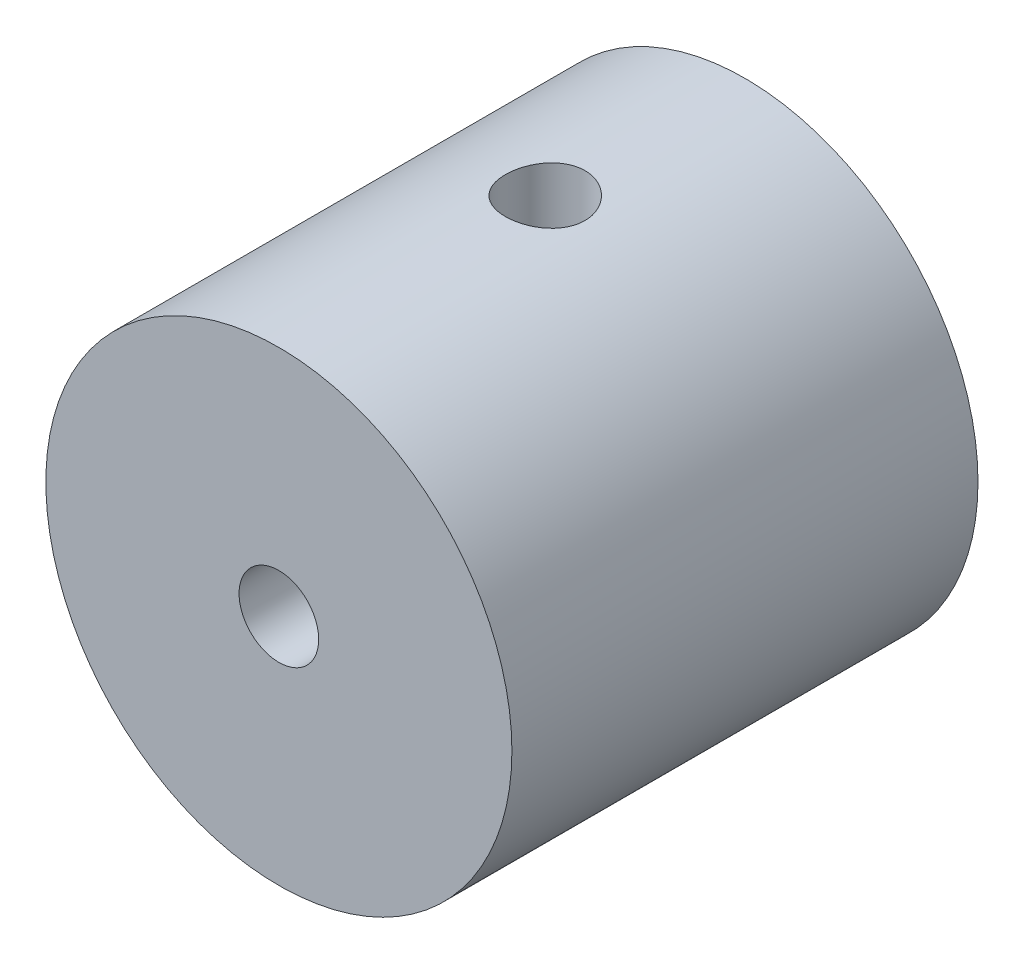
ISO-10303-21;
HEADER;
FILE_DESCRIPTION(('STEP AP214'),'2;1');
FILE_NAME('part.step','',(''),(''),'','','');
FILE_SCHEMA(('AUTOMOTIVE_DESIGN { 1 0 10303 214 1 1 1 1 }'));
ENDSEC;
DATA;
#1=APPLICATION_CONTEXT('core data for automotive mechanical design processes');
#2=APPLICATION_PROTOCOL_DEFINITION('international standard','automotive_design',2000,#1);
#3=PRODUCT_CONTEXT('',#1,'mechanical');
#4=PRODUCT('Part','Part','',(#3));
#5=PRODUCT_RELATED_PRODUCT_CATEGORY('part','',(#4));
#6=PRODUCT_DEFINITION_FORMATION('','',#4);
#7=PRODUCT_DEFINITION_CONTEXT('part definition',#1,'design');
#8=PRODUCT_DEFINITION('design','',#6,#7);
#9=PRODUCT_DEFINITION_SHAPE('','',#8);
#10=(LENGTH_UNIT() NAMED_UNIT(*) SI_UNIT(.MILLI.,.METRE.));
#11=(NAMED_UNIT(*) PLANE_ANGLE_UNIT() SI_UNIT($,.RADIAN.));
#12=(NAMED_UNIT(*) SI_UNIT($,.STERADIAN.) SOLID_ANGLE_UNIT());
#13=UNCERTAINTY_MEASURE_WITH_UNIT(LENGTH_MEASURE(1.E-05),#10,'distance_accuracy_value','');
#14=(GEOMETRIC_REPRESENTATION_CONTEXT(3) GLOBAL_UNCERTAINTY_ASSIGNED_CONTEXT((#13)) GLOBAL_UNIT_ASSIGNED_CONTEXT((#10,
#11,#12)) REPRESENTATION_CONTEXT('',''));
#15=CARTESIAN_POINT('',(0.,0.,0.));
#16=DIRECTION('',(0.,0.,1.));
#17=DIRECTION('',(1.,0.,0.));
#18=AXIS2_PLACEMENT_3D('',#15,#16,#17);
#19=CARTESIAN_POINT('',(0.,0.,0.));
#20=DIRECTION('',(0.,0.,1.));
#21=DIRECTION('',(1.,0.,0.));
#22=AXIS2_PLACEMENT_3D('',#19,#20,#21);
#23=CYLINDRICAL_SURFACE('',#22,1.89865);
#24=CARTESIAN_POINT('',(0.,0.,0.));
#25=DIRECTION('',(0.,0.,1.));
#26=DIRECTION('',(1.,0.,0.));
#27=AXIS2_PLACEMENT_3D('',#24,#25,#26);
#28=CIRCLE('',#27,1.89865);
#29=CARTESIAN_POINT('',(1.89865,0.,0.));
#30=VERTEX_POINT('',#29);
#31=EDGE_CURVE('E73',#30,#30,#28,.T.);
#32=ORIENTED_EDGE('',*,*,#31,.T.);
#33=EDGE_LOOP('',(#32));
#34=FACE_BOUND('',#33,.T.);
#35=CARTESIAN_POINT('',(0.,0.,-12.7));
#36=DIRECTION('',(0.,-0.707106781186547,0.707106781186548));
#37=DIRECTION('',(0.,0.707106781186547,0.707106781186549));
#38=AXIS2_PLACEMENT_3D('',#35,#36,#37);
#39=ELLIPSE('',#38,2.68509658019967,1.89864999999999);
#40=CARTESIAN_POINT('',(-1.89864999999997,0.,-12.7));
#41=VERTEX_POINT('',#40);
#42=CARTESIAN_POINT('',(1.89864999999999,0.,-12.7));
#43=VERTEX_POINT('',#42);
#44=EDGE_CURVE('E69',#41,#43,#39,.F.);
#45=ORIENTED_EDGE('',*,*,#44,.T.);
#46=CARTESIAN_POINT('',(0.,0.,-12.7));
#47=DIRECTION('',(0.,0.707106781186547,0.707106781186549));
#48=DIRECTION('',(0.,-0.707106781186547,0.707106781186548));
#49=AXIS2_PLACEMENT_3D('',#46,#47,#48);
#50=ELLIPSE('',#49,2.68509658019967,1.89864999999999);
#51=EDGE_CURVE('E13',#43,#41,#50,.F.);
#52=ORIENTED_EDGE('',*,*,#51,.T.);
#53=EDGE_LOOP('',(#45,#52));
#54=FACE_BOUND('',#53,.T.);
#55=ADVANCED_FACE('F46',(#34,#54),#23,.F.);
#56=CARTESIAN_POINT('',(0.,0.,-22.2250000000001));
#57=DIRECTION('',(0.,0.,1.));
#58=DIRECTION('',(1.,0.,0.));
#59=AXIS2_PLACEMENT_3D('',#56,#57,#58);
#60=CYLINDRICAL_SURFACE('',#59,11.1125);
#61=CARTESIAN_POINT('',(0.,-11.1124999999999,-10.8013499999999));
#62=CARTESIAN_POINT('',(-0.105822228264487,-11.1124981618856,-10.8013542075488));
#63=CARTESIAN_POINT('',(-0.211701226529086,-11.1109726937301,-10.8102269727728));
#64=CARTESIAN_POINT('',(-0.420486948857573,-11.1050342193384,-10.8454672932971));
#65=CARTESIAN_POINT('',(-0.523390894802783,-11.1006185997683,-10.8718506823632));
#66=CARTESIAN_POINT('',(-0.723175835773558,-11.089394838437,-10.941290149962));
#67=CARTESIAN_POINT('',(-0.820061778739054,-11.0825886936235,-10.9843323154787));
#68=CARTESIAN_POINT('',(-1.00522492539353,-11.0673312485652,-11.0858304907201));
#69=CARTESIAN_POINT('',(-1.09350305646538,-11.0588801258407,-11.1442848374582));
#70=CARTESIAN_POINT('',(-1.25984142987007,-11.0411740704959,-11.2755712227339));
#71=CARTESIAN_POINT('',(-1.33780285699396,-11.0319126044915,-11.3485275911649));
#72=CARTESIAN_POINT('',(-1.48044096143625,-11.0136793991156,-11.5064794677847));
#73=CARTESIAN_POINT('',(-1.5451167789052,-11.0047076785283,-11.5914757546001));
#74=CARTESIAN_POINT('',(-1.65974666930267,-10.9880064690993,-11.7717773231204));
#75=CARTESIAN_POINT('',(-1.70960248485878,-10.9802854192796,-11.8671459237006));
#76=CARTESIAN_POINT('',(-1.7925486823826,-10.9670506882431,-12.0650582825695));
#77=CARTESIAN_POINT('',(-1.8256402562131,-10.9615368501093,-12.1676015301826));
#78=CARTESIAN_POINT('',(-1.87380615556147,-10.9534060242082,-12.3759029268414));
#79=CARTESIAN_POINT('',(-1.88905142217093,-10.9507615702141,-12.4816204563071));
#80=CARTESIAN_POINT('',(-1.90162206802554,-10.9485858977546,-12.6941435497802));
#81=CARTESIAN_POINT('',(-1.89894878001368,-10.9490544477505,-12.8009490322782));
#82=CARTESIAN_POINT('',(-1.87589731758093,-10.9530267791418,-13.011392484879));
#83=CARTESIAN_POINT('',(-1.85571161890162,-10.9564975623133,-13.1150522520966));
#84=CARTESIAN_POINT('',(-1.79851059707276,-10.9660316032462,-13.3174918323712));
#85=CARTESIAN_POINT('',(-1.76149466997125,-10.9720949540414,-13.416271470164));
#86=CARTESIAN_POINT('',(-1.67149012961437,-10.9861663685527,-13.6067205026115));
#87=CARTESIAN_POINT('',(-1.61842201589715,-10.9941840721636,-13.6983515844937));
#88=CARTESIAN_POINT('',(-1.49787591256142,-11.0112541699214,-13.8714812458001));
#89=CARTESIAN_POINT('',(-1.43039670211536,-11.0203066516988,-13.9529789658566));
#90=CARTESIAN_POINT('',(-1.28189729162385,-11.0385710824753,-14.1046422338407));
#91=CARTESIAN_POINT('',(-1.20071204608565,-11.0477835719844,-14.174646214766));
#92=CARTESIAN_POINT('',(-1.0276621666073,-11.0652210490962,-14.3000628215833));
#93=CARTESIAN_POINT('',(-0.93579745720474,-11.0734460297202,-14.3554753443612));
#94=CARTESIAN_POINT('',(-0.743841251431178,-11.0879943295047,-14.4501525133858));
#95=CARTESIAN_POINT('',(-0.643742336048002,-11.094315909271,-14.4894024016191));
#96=CARTESIAN_POINT('',(-0.438240926826494,-11.104331284251,-14.5504876392027));
#97=CARTESIAN_POINT('',(-0.332838900411787,-11.1080253106279,-14.572324520511));
#98=CARTESIAN_POINT('',(-0.121115310579233,-11.1123381499893,-14.5977437277611));
#99=CARTESIAN_POINT('',(-0.014821100492509,-11.1129943113654,-14.6015477686558));
#100=CARTESIAN_POINT('',(0.196885576212192,-11.1112599511906,-14.5913851093089));
#101=CARTESIAN_POINT('',(0.30229807837252,-11.1088695530505,-14.5774191288999));
#102=CARTESIAN_POINT('',(0.508560690735103,-11.1013338091856,-14.532297272994));
#103=CARTESIAN_POINT('',(0.609435616897997,-11.0962061361596,-14.5012516302309));
#104=CARTESIAN_POINT('',(0.804548893095107,-11.0837684537404,-14.422969573908));
#105=CARTESIAN_POINT('',(0.898786854463265,-11.0764583166715,-14.3757322130967));
#106=CARTESIAN_POINT('',(1.07891096661853,-11.0603738237433,-14.2659031094232));
#107=CARTESIAN_POINT('',(1.16471184815793,-11.0515865556843,-14.2031734494668));
#108=CARTESIAN_POINT('',(1.32464830004621,-11.0335602869003,-14.0643295309645));
#109=CARTESIAN_POINT('',(1.39878297630114,-11.0243212516232,-13.9882142474947));
#110=CARTESIAN_POINT('',(1.53410844710197,-11.0063113701468,-13.8237634666165));
#111=CARTESIAN_POINT('',(1.59514914136415,-10.9975467342826,-13.7353036641667));
#112=CARTESIAN_POINT('',(1.70150428644863,-10.9815956781835,-13.5492555593587));
#113=CARTESIAN_POINT('',(1.7468192538292,-10.9744092061119,-13.4516675569772));
#114=CARTESIAN_POINT('',(1.82021435124198,-10.9624751716446,-13.2505454720078));
#115=CARTESIAN_POINT('',(1.84836805382854,-10.9577172123923,-13.1470388830988));
#116=CARTESIAN_POINT('',(1.88687214844282,-10.9511532664869,-12.9366773751239));
#117=CARTESIAN_POINT('',(1.89722417513577,-10.9493470087903,-12.8298227644127));
#118=CARTESIAN_POINT('',(1.89978370592229,-10.9489030626569,-12.6172981210472));
#119=CARTESIAN_POINT('',(1.89222756178648,-10.9502240999637,-12.5116309471133));
#120=CARTESIAN_POINT('',(1.85969753843754,-10.9557952341344,-12.3030953286224));
#121=CARTESIAN_POINT('',(1.83472372412374,-10.9600453200845,-12.2002268736386));
#122=CARTESIAN_POINT('',(1.76815962200421,-10.9709796586949,-12.0003070373016));
#123=CARTESIAN_POINT('',(1.72659069704358,-10.9776607809127,-11.9032483610413));
#124=CARTESIAN_POINT('',(1.62804091395072,-10.9927072580573,-11.71744445786));
#125=CARTESIAN_POINT('',(1.5710592278915,-11.0010727034546,-11.6286996778814));
#126=CARTESIAN_POINT('',(1.44246207327448,-11.0186755857909,-11.4608505019569));
#127=CARTESIAN_POINT('',(1.37067306936735,-11.0279225912511,-11.3818800432545));
#128=CARTESIAN_POINT('',(1.21486436922773,-11.0461713006349,-11.2370260274068));
#129=CARTESIAN_POINT('',(1.13084185805554,-11.0551729475337,-11.1711454905353));
#130=CARTESIAN_POINT('',(0.952221290600852,-11.0719930083117,-11.0539000454021));
#131=CARTESIAN_POINT('',(0.857550550765852,-11.0798023105682,-11.0026445451766));
#132=CARTESIAN_POINT('',(0.660846049473724,-11.0932691240436,-10.9168441290575));
#133=CARTESIAN_POINT('',(0.558819656247707,-11.0989287539355,-10.8822827506018));
#134=CARTESIAN_POINT('',(0.380345379096006,-11.1062389329515,-10.8382610455532));
#135=CARTESIAN_POINT('',(0.304970656110625,-11.1085741487438,-10.824441851937));
#136=CARTESIAN_POINT('',(0.153073843852295,-11.111705332762,-10.805984892897));
#137=CARTESIAN_POINT('',(0.0765517760019823,-11.1125013296914,-10.80134695626));
#138=CARTESIAN_POINT('',(0.,-11.1124999999999,-10.8013499999999));
#139=B_SPLINE_CURVE_WITH_KNOTS('',3,(#61,#62,#63,#64,#65,#66,#67,#68,#69,#70,#71,#72,#73,#74,
#75,#76,#77,#78,#79,#80,#81,#82,#83,#84,#85,#86,#87,#88,#89,#90,#91,#92,#93,#94,#95,#96,#97,#98,
#99,#100,#101,#102,#103,#104,#105,#106,#107,#108,#109,#110,#111,#112,#113,#114,#115,#116,#117,
#118,#119,#120,#121,#122,#123,#124,#125,#126,#127,#128,#129,#130,#131,#132,#133,#134,#135,#136,
#137,#138),.UNSPECIFIED.,.T.,.F.,(4,2,2,2,2,2,2,2,2,2,2,2,2,2,2,2,2,2,2,2,2,2,2,2,2,2,2,2,2,2,2,
2,2,2,2,2,2,2,4),(0.,0.317186840335999,0.634660884433462,0.951870351894169,1.26904560619793,
1.58906747613069,1.9091100514731,2.23122947892035,2.55332600189862,2.87231139806609,
3.19127306905902,3.50677287433381,3.82228400219792,4.13938406000424,4.45651099141814,
4.77777178458886,5.09903484796584,5.4205906078917,5.74211807492593,6.05968190462016,
6.37723287076464,6.69275799473194,7.00830158076962,7.32676243721847,7.64524768852363,
7.96720889174211,8.28915951818597,8.60972001095081,8.93025106620168,9.24657536279723,
9.56289848075492,9.87881570304513,10.1947498988263,10.5146217086495,10.8345672378918,
11.1568469880608,11.4788082766001,11.7082654441735,11.9377183327622),.UNSPECIFIED.);
#140=CARTESIAN_POINT('',(0.,-11.1124999999999,-10.8013499999999));
#141=VERTEX_POINT('',#140);
#142=EDGE_CURVE('E77',#141,#141,#139,.T.);
#143=ORIENTED_EDGE('',*,*,#142,.F.);
#144=EDGE_LOOP('',(#143));
#145=FACE_BOUND('',#144,.T.);
#146=CARTESIAN_POINT('',(1.11022302462516E-13,11.1125,-14.59865));
#147=CARTESIAN_POINT('',(-0.105822228264438,11.1124981618857,-14.5986457924512));
#148=CARTESIAN_POINT('',(-0.2117012265291,11.1109726937303,-14.5897730272274));
#149=CARTESIAN_POINT('',(-0.420486948857643,11.1050342193385,-14.5545327067029));
#150=CARTESIAN_POINT('',(-0.523390894802844,11.1006185997683,-14.5281493176366));
#151=CARTESIAN_POINT('',(-0.723175835773671,11.0893948384369,-14.4587098500377));
#152=CARTESIAN_POINT('',(-0.820061778739234,11.0825886936236,-14.4156676845212));
#153=CARTESIAN_POINT('',(-1.00522492539369,11.0673312485654,-14.3141695092799));
#154=CARTESIAN_POINT('',(-1.09350305646545,11.0588801258407,-14.2557151625418));
#155=CARTESIAN_POINT('',(-1.2598414298701,11.0411740704959,-14.1244287772661));
#156=CARTESIAN_POINT('',(-1.33780285699404,11.0319126044916,-14.0514724088351));
#157=CARTESIAN_POINT('',(-1.48044096143631,11.0136793991157,-13.8935205322154));
#158=CARTESIAN_POINT('',(-1.5451167789052,11.0047076785283,-13.8085242453999));
#159=CARTESIAN_POINT('',(-1.65974666930269,10.9880064690993,-13.6282226768796));
#160=CARTESIAN_POINT('',(-1.70960248485888,10.9802854192797,-13.5328540762993));
#161=CARTESIAN_POINT('',(-1.7925486823827,10.9670506882433,-13.3349417174303));
#162=CARTESIAN_POINT('',(-1.82564025621311,10.9615368501094,-13.2323984698171));
#163=CARTESIAN_POINT('',(-1.87380615556143,10.9534060242083,-13.0240970731581));
#164=CARTESIAN_POINT('',(-1.88905142217094,10.9507615702143,-12.9183795436925));
#165=CARTESIAN_POINT('',(-1.9016220680256,10.9485858977547,-12.7058564502193));
#166=CARTESIAN_POINT('',(-1.89894878001376,10.9490544477506,-12.5990509677213));
#167=CARTESIAN_POINT('',(-1.87589731758091,10.9530267791419,-12.3886075151205));
#168=CARTESIAN_POINT('',(-1.85571161890149,10.9564975623134,-12.284947747903));
#169=CARTESIAN_POINT('',(-1.79851059707261,10.9660316032464,-12.0825081676285));
#170=CARTESIAN_POINT('',(-1.7614946699712,10.9720949540415,-11.9837285298357));
#171=CARTESIAN_POINT('',(-1.67149012961429,10.9861663685528,-11.7932794973882));
#172=CARTESIAN_POINT('',(-1.61842201589693,10.9941840721638,-11.7016484155061));
#173=CARTESIAN_POINT('',(-1.49787591256123,11.0112541699216,-11.5285187541996));
#174=CARTESIAN_POINT('',(-1.43039670211534,11.0203066516989,-11.4470210341431));
#175=CARTESIAN_POINT('',(-1.28189729162384,11.0385710824755,-11.2953577661589));
#176=CARTESIAN_POINT('',(-1.20071204608548,11.0477835719846,-11.2253537852339));
#177=CARTESIAN_POINT('',(-1.02766216660708,11.0652210490964,-11.0999371784167));
#178=CARTESIAN_POINT('',(-0.935797457204636,11.0734460297203,-11.0445246556387));
#179=CARTESIAN_POINT('',(-0.743841251431144,11.0879943295048,-10.9498474866141));
#180=CARTESIAN_POINT('',(-0.643742336047926,11.0943159092711,-10.9105975983809));
#181=CARTESIAN_POINT('',(-0.438240926826424,11.1043312842511,-10.8495123607974));
#182=CARTESIAN_POINT('',(-0.332838900411764,11.108025310628,-10.8276754794889));
#183=CARTESIAN_POINT('',(-0.121115310579274,11.1123381499895,-10.8022562722389));
#184=CARTESIAN_POINT('',(-0.014821100492565,11.1129943113656,-10.7984522313444));
#185=CARTESIAN_POINT('',(0.196885576212167,11.1112599511907,-10.8086148906911));
#186=CARTESIAN_POINT('',(0.30229807837254,11.1088695530505,-10.8225808710997));
#187=CARTESIAN_POINT('',(0.508560690735037,11.1013338091856,-10.8677027270056));
#188=CARTESIAN_POINT('',(0.609435616897801,11.0962061361597,-10.8987483697691));
#189=CARTESIAN_POINT('',(0.804548893094944,11.0837684537406,-10.9770304260921));
#190=CARTESIAN_POINT('',(0.898786854463263,11.0764583166716,-11.024267786903));
#191=CARTESIAN_POINT('',(1.07891096661853,11.0603738237434,-11.1340968905764));
#192=CARTESIAN_POINT('',(1.16471184815775,11.0515865556844,-11.1968265505331));
#193=CARTESIAN_POINT('',(1.32464830004606,11.0335602869004,-11.3356704690355));
#194=CARTESIAN_POINT('',(1.39878297630118,11.0243212516232,-11.4117857525051));
#195=CARTESIAN_POINT('',(1.53410844710206,11.0063113701468,-11.5762365333832));
#196=CARTESIAN_POINT('',(1.59514914136409,10.9975467342828,-11.6646963358332));
#197=CARTESIAN_POINT('',(1.70150428644852,10.9815956781837,-11.8507444406413));
#198=CARTESIAN_POINT('',(1.74681925382919,10.974409206112,-11.9483324430228));
#199=CARTESIAN_POINT('',(1.82021435124198,10.9624751716446,-12.1494545279921));
#200=CARTESIAN_POINT('',(1.84836805382847,10.9577172123924,-12.2529611169011));
#201=CARTESIAN_POINT('',(1.88687214844277,10.9511532664871,-12.4633226248758));
#202=CARTESIAN_POINT('',(1.89722417513583,10.9493470087904,-12.5701772355869));
#203=CARTESIAN_POINT('',(1.89978370592243,10.948903062657,-12.7827018789523));
#204=CARTESIAN_POINT('',(1.89222756178658,10.9502240999638,-12.8883690528862));
#205=CARTESIAN_POINT('',(1.85969753843761,10.9557952341345,-13.0969046713772));
#206=CARTESIAN_POINT('',(1.83472372412383,10.9600453200846,-13.199773126361));
#207=CARTESIAN_POINT('',(1.76815962200437,10.970979658695,-13.3996929626981));
#208=CARTESIAN_POINT('',(1.72659069704379,10.9776607809128,-13.4967516389585));
#209=CARTESIAN_POINT('',(1.62804091395086,10.9927072580574,-13.6825555421398));
#210=CARTESIAN_POINT('',(1.57105922789151,11.0010727034547,-13.7713003221183));
#211=CARTESIAN_POINT('',(1.44246207327452,11.018675585791,-13.9391494980429));
#212=CARTESIAN_POINT('',(1.37067306936757,11.0279225912512,-14.0181199567454));
#213=CARTESIAN_POINT('',(1.21486436922796,11.046171300635,-14.1629739725931));
#214=CARTESIAN_POINT('',(1.13084185805563,11.0551729475338,-14.2288545094643));
#215=CARTESIAN_POINT('',(0.952221290600912,11.0719930083118,-14.3460999545976));
#216=CARTESIAN_POINT('',(0.857550550766028,11.0798023105684,-14.3973554548234));
#217=CARTESIAN_POINT('',(0.660846049473887,11.0932691240437,-14.4831558709425));
#218=CARTESIAN_POINT('',(0.558819656247741,11.0989287539355,-14.517717249398));
#219=CARTESIAN_POINT('',(0.380345379095998,11.1062389329515,-14.5617389544467));
#220=CARTESIAN_POINT('',(0.304970656110665,11.1085741487439,-14.5755581480631));
#221=CARTESIAN_POINT('',(0.153073843852391,11.1117053327621,-14.5940151071031));
#222=CARTESIAN_POINT('',(0.0765517760020871,11.1125013296915,-14.5986530437399));
#223=CARTESIAN_POINT('',(1.11022302462516E-13,11.1125,-14.59865));
#224=B_SPLINE_CURVE_WITH_KNOTS('',3,(#146,#147,#148,#149,#150,#151,#152,#153,#154,#155,#156,
#157,#158,#159,#160,#161,#162,#163,#164,#165,#166,#167,#168,#169,#170,#171,#172,#173,#174,#175,
#176,#177,#178,#179,#180,#181,#182,#183,#184,#185,#186,#187,#188,#189,#190,#191,#192,#193,#194,
#195,#196,#197,#198,#199,#200,#201,#202,#203,#204,#205,#206,#207,#208,#209,#210,#211,#212,#213,
#214,#215,#216,#217,#218,#219,#220,#221,#222,#223),.UNSPECIFIED.,.T.,.F.,(4,2,2,2,2,2,2,2,2,2,2,
2,2,2,2,2,2,2,2,2,2,2,2,2,2,2,2,2,2,2,2,2,2,2,2,2,2,2,4),(0.,0.317186840336136,
0.634660884433771,0.951870351894419,1.26904560619809,1.58906747613084,1.90911005147324,
2.23122947892064,2.55332600189907,2.87231139806667,3.1912730690597,3.50677287433434,
3.82228400219832,4.13938406000466,4.45651099141855,4.7777717845892,5.09903484796611,
5.42059060789191,5.74211807492608,6.05968190462028,6.3772328707647,6.69275799473197,
7.00830158076965,7.32676243721855,7.64524768852374,7.96720889174228,8.28915951818622,
8.60972001095082,8.93025106620143,9.24657536279705,9.56289848075483,9.87881570304513,
10.1947498988264,10.5146217086496,10.8345672378918,11.1568469880609,11.4788082766003,
11.7082654441737,11.9377183327624),.UNSPECIFIED.);
#225=CARTESIAN_POINT('',(1.11022302462516E-13,11.1125,-14.59865));
#226=VERTEX_POINT('',#225);
#227=EDGE_CURVE('E65',#226,#226,#224,.T.);
#228=ORIENTED_EDGE('',*,*,#227,.F.);
#229=EDGE_LOOP('',(#228));
#230=FACE_BOUND('',#229,.T.);
#231=CARTESIAN_POINT('',(0.,0.,-22.2250000000001));
#232=DIRECTION('',(0.,0.,1.));
#233=DIRECTION('',(1.,0.,0.));
#234=AXIS2_PLACEMENT_3D('',#231,#232,#233);
#235=CIRCLE('',#234,11.1125);
#236=CARTESIAN_POINT('',(11.1125,0.,-22.2250000000001));
#237=VERTEX_POINT('',#236);
#238=EDGE_CURVE('E91',#237,#237,#235,.T.);
#239=ORIENTED_EDGE('',*,*,#238,.T.);
#240=EDGE_LOOP('',(#239));
#241=FACE_BOUND('',#240,.T.);
#242=CARTESIAN_POINT('',(0.,0.,0.));
#243=DIRECTION('',(0.,0.,1.));
#244=DIRECTION('',(1.,0.,0.));
#245=AXIS2_PLACEMENT_3D('',#242,#243,#244);
#246=CIRCLE('',#245,11.1125);
#247=CARTESIAN_POINT('',(11.1125,0.,0.));
#248=VERTEX_POINT('',#247);
#249=EDGE_CURVE('E90',#248,#248,#246,.T.);
#250=ORIENTED_EDGE('',*,*,#249,.F.);
#251=EDGE_LOOP('',(#250));
#252=FACE_BOUND('',#251,.T.);
#253=ADVANCED_FACE('F48',(#145,#230,#241,#252),#60,.T.);
#254=CARTESIAN_POINT('',(0.,0.,-22.2250000000001));
#255=DIRECTION('',(0.,0.,1.));
#256=DIRECTION('',(1.,0.,0.));
#257=AXIS2_PLACEMENT_3D('',#254,#255,#256);
#258=PLANE('',#257);
#259=CARTESIAN_POINT('',(0.,0.,-22.2250000000001));
#260=DIRECTION('',(0.,0.,1.));
#261=DIRECTION('',(1.,0.,0.));
#262=AXIS2_PLACEMENT_3D('',#259,#260,#261);
#263=CIRCLE('',#262,1.89864999999999);
#264=CARTESIAN_POINT('',(1.89865,0.,-22.2250000000001));
#265=VERTEX_POINT('',#264);
#266=EDGE_CURVE('E87',#265,#265,#263,.T.);
#267=ORIENTED_EDGE('',*,*,#266,.T.);
#268=EDGE_LOOP('',(#267));
#269=FACE_BOUND('',#268,.T.);
#270=ORIENTED_EDGE('',*,*,#238,.F.);
#271=EDGE_LOOP('',(#270));
#272=FACE_BOUND('',#271,.T.);
#273=ADVANCED_FACE('F108',(#269,#272),#258,.F.);
#274=CARTESIAN_POINT('',(0.,0.,0.));
#275=DIRECTION('',(0.,0.,1.));
#276=DIRECTION('',(1.,0.,0.));
#277=AXIS2_PLACEMENT_3D('',#274,#275,#276);
#278=PLANE('',#277);
#279=ORIENTED_EDGE('',*,*,#31,.F.);
#280=EDGE_LOOP('',(#279));
#281=FACE_BOUND('',#280,.T.);
#282=ORIENTED_EDGE('',*,*,#249,.T.);
#283=EDGE_LOOP('',(#282));
#284=FACE_BOUND('',#283,.T.);
#285=ADVANCED_FACE('F107',(#281,#284),#278,.T.);
#286=CARTESIAN_POINT('',(0.,0.,-12.7));
#287=DIRECTION('',(0.,0.707106781186547,0.707106781186549));
#288=DIRECTION('',(0.,-0.707106781186547,0.707106781186548));
#289=AXIS2_PLACEMENT_3D('',#286,#287,#288);
#290=ELLIPSE('',#289,2.68509658019967,1.89864999999999);
#291=EDGE_CURVE('E72',#43,#41,#290,.T.);
#292=ORIENTED_EDGE('',*,*,#291,.T.);
#293=CARTESIAN_POINT('',(0.,0.,-12.7));
#294=DIRECTION('',(0.,-0.707106781186547,0.707106781186548));
#295=DIRECTION('',(0.,0.707106781186547,0.707106781186549));
#296=AXIS2_PLACEMENT_3D('',#293,#294,#295);
#297=ELLIPSE('',#296,2.68509658019967,1.89864999999999);
#298=EDGE_CURVE('E55',#41,#43,#297,.T.);
#299=ORIENTED_EDGE('',*,*,#298,.T.);
#300=EDGE_LOOP('',(#292,#299));
#301=FACE_BOUND('',#300,.T.);
#302=ORIENTED_EDGE('',*,*,#266,.F.);
#303=EDGE_LOOP('',(#302));
#304=FACE_BOUND('',#303,.T.);
#305=ADVANCED_FACE('F75',(#301,#304),#23,.F.);
#306=CARTESIAN_POINT('',(0.,0.,-12.7));
#307=DIRECTION('',(0.,-1.,0.));
#308=DIRECTION('',(0.,0.,-1.));
#309=AXIS2_PLACEMENT_3D('',#306,#307,#308);
#310=CYLINDRICAL_SURFACE('',#309,1.89864999999999);
#311=ORIENTED_EDGE('',*,*,#227,.T.);
#312=EDGE_LOOP('',(#311));
#313=FACE_BOUND('',#312,.T.);
#314=ORIENTED_EDGE('',*,*,#291,.F.);
#315=ORIENTED_EDGE('',*,*,#44,.F.);
#316=EDGE_LOOP('',(#314,#315));
#317=FACE_BOUND('',#316,.T.);
#318=ADVANCED_FACE('F71',(#313,#317),#310,.F.);
#319=CARTESIAN_POINT('',(0.,0.,-12.7));
#320=DIRECTION('',(0.,1.,0.));
#321=DIRECTION('',(0.,0.,1.));
#322=AXIS2_PLACEMENT_3D('',#319,#320,#321);
#323=CYLINDRICAL_SURFACE('',#322,1.89864999999999);
#324=ORIENTED_EDGE('',*,*,#142,.T.);
#325=EDGE_LOOP('',(#324));
#326=FACE_BOUND('',#325,.T.);
#327=ORIENTED_EDGE('',*,*,#298,.F.);
#328=ORIENTED_EDGE('',*,*,#51,.F.);
#329=EDGE_LOOP('',(#327,#328));
#330=FACE_BOUND('',#329,.T.);
#331=ADVANCED_FACE('F61',(#326,#330),#323,.F.);
#332=CLOSED_SHELL('',(#55,#253,#273,#285,#305,#318,#331));
#333=MANIFOLD_SOLID_BREP('B2',#332);
#334=ADVANCED_BREP_SHAPE_REPRESENTATION('',(#18,#333),#14);
#335=SHAPE_DEFINITION_REPRESENTATION(#9,#334);
ENDSEC;
END-ISO-10303-21;
